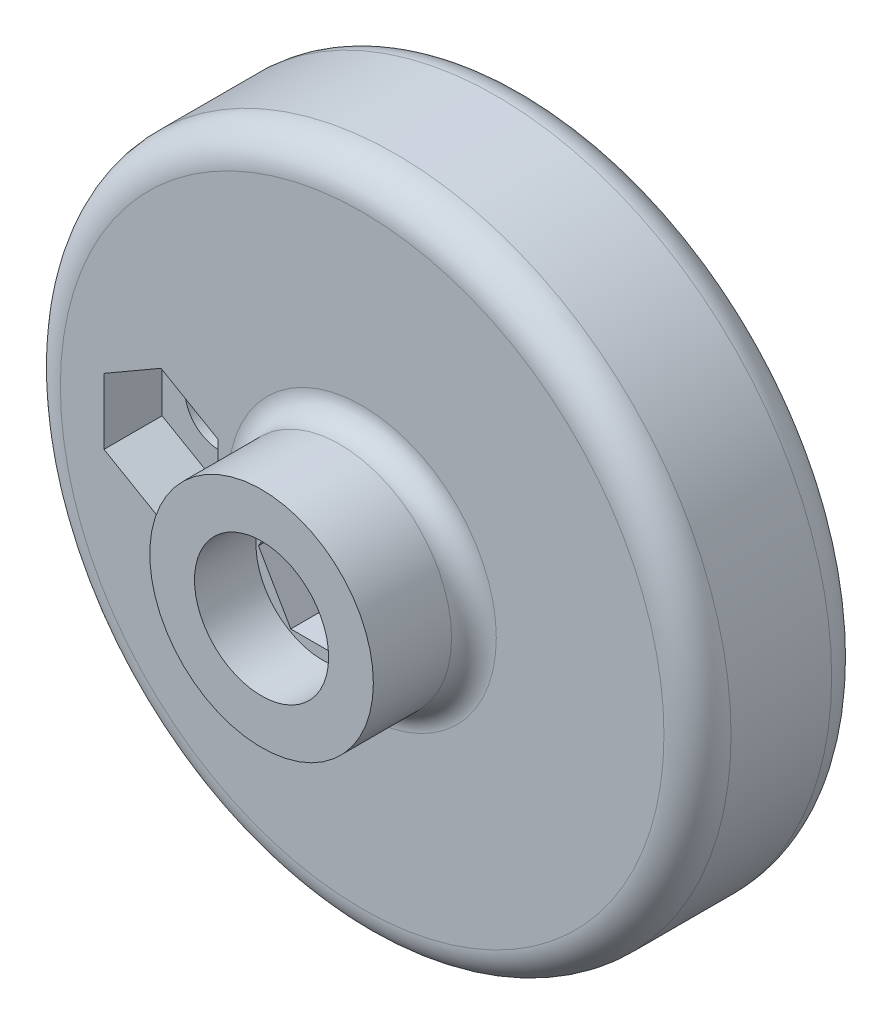
ISO-10303-21;
HEADER;
FILE_DESCRIPTION(('STEP AP214'),'2;1');
FILE_NAME('part.step','',(''),(''),'','','');
FILE_SCHEMA(('AUTOMOTIVE_DESIGN { 1 0 10303 214 1 1 1 1 }'));
ENDSEC;
DATA;
#1=APPLICATION_CONTEXT('core data for automotive mechanical design processes');
#2=APPLICATION_PROTOCOL_DEFINITION('international standard','automotive_design',2000,#1);
#3=PRODUCT_CONTEXT('',#1,'mechanical');
#4=PRODUCT('Part','Part','',(#3));
#5=PRODUCT_RELATED_PRODUCT_CATEGORY('part','',(#4));
#6=PRODUCT_DEFINITION_FORMATION('','',#4);
#7=PRODUCT_DEFINITION_CONTEXT('part definition',#1,'design');
#8=PRODUCT_DEFINITION('design','',#6,#7);
#9=PRODUCT_DEFINITION_SHAPE('','',#8);
#10=(LENGTH_UNIT() NAMED_UNIT(*) SI_UNIT(.MILLI.,.METRE.));
#11=(NAMED_UNIT(*) PLANE_ANGLE_UNIT() SI_UNIT($,.RADIAN.));
#12=(NAMED_UNIT(*) SI_UNIT($,.STERADIAN.) SOLID_ANGLE_UNIT());
#13=UNCERTAINTY_MEASURE_WITH_UNIT(LENGTH_MEASURE(1.E-05),#10,'distance_accuracy_value','');
#14=(GEOMETRIC_REPRESENTATION_CONTEXT(3) GLOBAL_UNCERTAINTY_ASSIGNED_CONTEXT((#13)) GLOBAL_UNIT_ASSIGNED_CONTEXT((#10,
#11,#12)) REPRESENTATION_CONTEXT('',''));
#15=CARTESIAN_POINT('',(0.,0.,0.));
#16=DIRECTION('',(0.,0.,1.));
#17=DIRECTION('',(1.,0.,0.));
#18=AXIS2_PLACEMENT_3D('',#15,#16,#17);
#19=CARTESIAN_POINT('',(0.,0.,0.));
#20=DIRECTION('',(0.,0.,1.));
#21=DIRECTION('',(1.,0.,0.));
#22=AXIS2_PLACEMENT_3D('',#19,#20,#21);
#23=CYLINDRICAL_SURFACE('',#22,3.25);
#24=CARTESIAN_POINT('',(0.,0.,3.));
#25=DIRECTION('',(0.,0.,1.));
#26=DIRECTION('',(1.,0.,0.));
#27=AXIS2_PLACEMENT_3D('',#24,#25,#26);
#28=CIRCLE('',#27,3.25);
#29=CARTESIAN_POINT('',(3.25,0.,3.));
#30=VERTEX_POINT('',#29);
#31=EDGE_CURVE('E242',#30,#30,#28,.F.);
#32=ORIENTED_EDGE('',*,*,#31,.T.);
#33=EDGE_LOOP('',(#32));
#34=FACE_BOUND('',#33,.T.);
#35=CARTESIAN_POINT('',(0.,0.,13.));
#36=DIRECTION('',(0.,0.,1.));
#37=DIRECTION('',(1.,0.,0.));
#38=AXIS2_PLACEMENT_3D('',#35,#36,#37);
#39=CIRCLE('',#38,3.25);
#40=CARTESIAN_POINT('',(3.25,0.,13.));
#41=VERTEX_POINT('',#40);
#42=EDGE_CURVE('E169',#41,#41,#39,.F.);
#43=ORIENTED_EDGE('',*,*,#42,.F.);
#44=EDGE_LOOP('',(#43));
#45=FACE_BOUND('',#44,.T.);
#46=ADVANCED_FACE('F32',(#34,#45),#23,.F.);
#47=CARTESIAN_POINT('',(-18.,0.,0.));
#48=DIRECTION('',(0.,0.,1.));
#49=DIRECTION('',(1.,0.,0.));
#50=AXIS2_PLACEMENT_3D('',#47,#48,#49);
#51=CYLINDRICAL_SURFACE('',#50,3.05);
#52=CARTESIAN_POINT('',(-18.,0.,0.));
#53=DIRECTION('',(0.,0.,1.));
#54=DIRECTION('',(1.,0.,0.));
#55=AXIS2_PLACEMENT_3D('',#52,#53,#54);
#56=CIRCLE('',#55,3.05);
#57=CARTESIAN_POINT('',(-14.95,0.,0.));
#58=VERTEX_POINT('',#57);
#59=EDGE_CURVE('E230',#58,#58,#56,.T.);
#60=ORIENTED_EDGE('',*,*,#59,.F.);
#61=EDGE_LOOP('',(#60));
#62=FACE_BOUND('',#61,.T.);
#63=CARTESIAN_POINT('',(-18.,0.,9.8));
#64=DIRECTION('',(0.,0.,1.));
#65=DIRECTION('',(1.,0.,0.));
#66=AXIS2_PLACEMENT_3D('',#63,#64,#65);
#67=CIRCLE('',#66,3.05);
#68=CARTESIAN_POINT('',(-14.95,0.,9.8));
#69=VERTEX_POINT('',#68);
#70=EDGE_CURVE('E220',#69,#69,#67,.F.);
#71=ORIENTED_EDGE('',*,*,#70,.F.);
#72=EDGE_LOOP('',(#71));
#73=FACE_BOUND('',#72,.T.);
#74=ADVANCED_FACE('F272',(#62,#73),#51,.F.);
#75=CARTESIAN_POINT('',(0.,0.,15.));
#76=DIRECTION('',(0.,0.,1.));
#77=DIRECTION('',(1.,0.,0.));
#78=AXIS2_PLACEMENT_3D('',#75,#76,#77);
#79=PLANE('',#78);
#80=CARTESIAN_POINT('',(0.,0.,15.));
#81=DIRECTION('',(0.,0.,1.));
#82=DIRECTION('',(1.,0.,0.));
#83=AXIS2_PLACEMENT_3D('',#80,#81,#82);
#84=CIRCLE('',#83,12.);
#85=CARTESIAN_POINT('',(12.,0.,15.));
#86=VERTEX_POINT('',#85);
#87=EDGE_CURVE('E11',#86,#86,#84,.F.);
#88=ORIENTED_EDGE('',*,*,#87,.T.);
#89=EDGE_LOOP('',(#88));
#90=FACE_BOUND('',#89,.T.);
#91=DIRECTION('',(-0.866025403784438,-0.5,0.));
#92=VECTOR('',#91,1.);
#93=CARTESIAN_POINT('',(-18.,5.88897274573418,15.));
#94=LINE('',#93,#92);
#95=CARTESIAN_POINT('',(-18.,5.88897274573418,15.));
#96=VERTEX_POINT('',#95);
#97=CARTESIAN_POINT('',(-23.1,2.94448637286709,15.));
#98=VERTEX_POINT('',#97);
#99=EDGE_CURVE('E55',#96,#98,#94,.T.);
#100=ORIENTED_EDGE('',*,*,#99,.F.);
#101=DIRECTION('',(-0.866025403784438,0.5,0.));
#102=VECTOR('',#101,1.);
#103=CARTESIAN_POINT('',(-12.9,2.94448637286709,15.));
#104=LINE('',#103,#102);
#105=CARTESIAN_POINT('',(-12.9,2.94448637286709,15.));
#106=VERTEX_POINT('',#105);
#107=EDGE_CURVE('E187',#106,#96,#104,.T.);
#108=ORIENTED_EDGE('',*,*,#107,.F.);
#109=DIRECTION('',(0.,1.,0.));
#110=VECTOR('',#109,1.);
#111=CARTESIAN_POINT('',(-12.9,-2.94448637286709,15.));
#112=LINE('',#111,#110);
#113=CARTESIAN_POINT('',(-12.9,-2.94448637286709,15.));
#114=VERTEX_POINT('',#113);
#115=EDGE_CURVE('E213',#114,#106,#112,.T.);
#116=ORIENTED_EDGE('',*,*,#115,.F.);
#117=DIRECTION('',(0.866025403784438,0.5,0.));
#118=VECTOR('',#117,1.);
#119=CARTESIAN_POINT('',(-18.,-5.88897274573418,15.));
#120=LINE('',#119,#118);
#121=CARTESIAN_POINT('',(-18.,-5.88897274573418,15.));
#122=VERTEX_POINT('',#121);
#123=EDGE_CURVE('E210',#122,#114,#120,.T.);
#124=ORIENTED_EDGE('',*,*,#123,.F.);
#125=DIRECTION('',(0.866025403784439,-0.5,0.));
#126=VECTOR('',#125,1.);
#127=CARTESIAN_POINT('',(-23.1,-2.94448637286709,15.));
#128=LINE('',#127,#126);
#129=CARTESIAN_POINT('',(-23.1,-2.94448637286709,15.));
#130=VERTEX_POINT('',#129);
#131=EDGE_CURVE('E207',#130,#122,#128,.T.);
#132=ORIENTED_EDGE('',*,*,#131,.F.);
#133=DIRECTION('',(0.,-1.,0.));
#134=VECTOR('',#133,1.);
#135=CARTESIAN_POINT('',(-23.1,2.94448637286709,15.));
#136=LINE('',#135,#134);
#137=EDGE_CURVE('E204',#98,#130,#136,.T.);
#138=ORIENTED_EDGE('',*,*,#137,.F.);
#139=EDGE_LOOP('',(#100,#108,#116,#124,#132,#138));
#140=FACE_BOUND('',#139,.T.);
#141=CARTESIAN_POINT('',(0.,0.,15.));
#142=DIRECTION('',(0.,0.,1.));
#143=DIRECTION('',(1.,0.,0.));
#144=AXIS2_PLACEMENT_3D('',#141,#142,#143);
#145=CIRCLE('',#144,27.);
#146=CARTESIAN_POINT('',(27.,0.,15.));
#147=VERTEX_POINT('',#146);
#148=EDGE_CURVE('E251',#147,#147,#145,.T.);
#149=ORIENTED_EDGE('',*,*,#148,.T.);
#150=EDGE_LOOP('',(#149));
#151=FACE_BOUND('',#150,.T.);
#152=ADVANCED_FACE('F278',(#90,#140,#151),#79,.T.);
#153=CARTESIAN_POINT('',(0.,0.,15.));
#154=DIRECTION('',(0.,0.,-1.));
#155=DIRECTION('',(-1.,0.,0.));
#156=AXIS2_PLACEMENT_3D('',#153,#154,#155);
#157=CYLINDRICAL_SURFACE('',#156,30.);
#158=CARTESIAN_POINT('',(0.,0.,3.));
#159=DIRECTION('',(0.,0.,1.));
#160=DIRECTION('',(1.,0.,0.));
#161=AXIS2_PLACEMENT_3D('',#158,#159,#160);
#162=CIRCLE('',#161,30.);
#163=CARTESIAN_POINT('',(30.,0.,3.));
#164=VERTEX_POINT('',#163);
#165=EDGE_CURVE('E248',#164,#164,#162,.T.);
#166=ORIENTED_EDGE('',*,*,#165,.T.);
#167=EDGE_LOOP('',(#166));
#168=FACE_BOUND('',#167,.T.);
#169=CARTESIAN_POINT('',(0.,0.,12.));
#170=DIRECTION('',(0.,0.,1.));
#171=DIRECTION('',(1.,0.,0.));
#172=AXIS2_PLACEMENT_3D('',#169,#170,#171);
#173=CIRCLE('',#172,30.);
#174=CARTESIAN_POINT('',(30.,0.,12.));
#175=VERTEX_POINT('',#174);
#176=EDGE_CURVE('E245',#175,#175,#173,.F.);
#177=ORIENTED_EDGE('',*,*,#176,.T.);
#178=EDGE_LOOP('',(#177));
#179=FACE_BOUND('',#178,.T.);
#180=ADVANCED_FACE('F294',(#168,#179),#157,.T.);
#181=CARTESIAN_POINT('',(0.,0.,0.));
#182=DIRECTION('',(0.,0.,1.));
#183=DIRECTION('',(1.,0.,0.));
#184=AXIS2_PLACEMENT_3D('',#181,#182,#183);
#185=PLANE('',#184);
#186=ORIENTED_EDGE('',*,*,#59,.T.);
#187=EDGE_LOOP('',(#186));
#188=FACE_BOUND('',#187,.T.);
#189=CARTESIAN_POINT('',(0.,0.,0.));
#190=DIRECTION('',(0.,0.,1.));
#191=DIRECTION('',(1.,0.,0.));
#192=AXIS2_PLACEMENT_3D('',#189,#190,#191);
#193=CIRCLE('',#192,6.25);
#194=CARTESIAN_POINT('',(6.25,0.,0.));
#195=VERTEX_POINT('',#194);
#196=EDGE_CURVE('E239',#195,#195,#193,.T.);
#197=ORIENTED_EDGE('',*,*,#196,.T.);
#198=EDGE_LOOP('',(#197));
#199=FACE_BOUND('',#198,.T.);
#200=CARTESIAN_POINT('',(0.,0.,0.));
#201=DIRECTION('',(0.,0.,1.));
#202=DIRECTION('',(1.,0.,0.));
#203=AXIS2_PLACEMENT_3D('',#200,#201,#202);
#204=CIRCLE('',#203,27.);
#205=CARTESIAN_POINT('',(27.,0.,0.));
#206=VERTEX_POINT('',#205);
#207=EDGE_CURVE('E236',#206,#206,#204,.F.);
#208=ORIENTED_EDGE('',*,*,#207,.T.);
#209=EDGE_LOOP('',(#208));
#210=FACE_BOUND('',#209,.T.);
#211=ADVANCED_FACE('F291',(#188,#199,#210),#185,.F.);
#212=CARTESIAN_POINT('',(0.,0.,24.));
#213=DIRECTION('',(0.,0.,-1.));
#214=DIRECTION('',(-1.,0.,0.));
#215=AXIS2_PLACEMENT_3D('',#212,#213,#214);
#216=CYLINDRICAL_SURFACE('',#215,10.);
#217=CARTESIAN_POINT('',(0.,0.,17.));
#218=DIRECTION('',(0.,0.,1.));
#219=DIRECTION('',(1.,0.,0.));
#220=AXIS2_PLACEMENT_3D('',#217,#218,#219);
#221=CIRCLE('',#220,10.);
#222=CARTESIAN_POINT('',(10.,0.,17.));
#223=VERTEX_POINT('',#222);
#224=EDGE_CURVE('E40',#223,#223,#221,.T.);
#225=ORIENTED_EDGE('',*,*,#224,.T.);
#226=EDGE_LOOP('',(#225));
#227=FACE_BOUND('',#226,.T.);
#228=CARTESIAN_POINT('',(0.,0.,24.));
#229=DIRECTION('',(0.,0.,1.));
#230=DIRECTION('',(1.,0.,0.));
#231=AXIS2_PLACEMENT_3D('',#228,#229,#230);
#232=CIRCLE('',#231,10.);
#233=CARTESIAN_POINT('',(10.,0.,24.));
#234=VERTEX_POINT('',#233);
#235=EDGE_CURVE('E233',#234,#234,#232,.T.);
#236=ORIENTED_EDGE('',*,*,#235,.F.);
#237=EDGE_LOOP('',(#236));
#238=FACE_BOUND('',#237,.T.);
#239=ADVANCED_FACE('F260',(#227,#238),#216,.T.);
#240=CARTESIAN_POINT('',(0.,0.,24.));
#241=DIRECTION('',(0.,0.,1.));
#242=DIRECTION('',(1.,0.,0.));
#243=AXIS2_PLACEMENT_3D('',#240,#241,#242);
#244=PLANE('',#243);
#245=CARTESIAN_POINT('',(0.,0.,24.));
#246=DIRECTION('',(0.,0.,1.));
#247=DIRECTION('',(1.,0.,0.));
#248=AXIS2_PLACEMENT_3D('',#245,#246,#247);
#249=CIRCLE('',#248,6.);
#250=CARTESIAN_POINT('',(6.,0.,24.));
#251=VERTEX_POINT('',#250);
#252=EDGE_CURVE('E180',#251,#251,#249,.T.);
#253=ORIENTED_EDGE('',*,*,#252,.F.);
#254=EDGE_LOOP('',(#253));
#255=FACE_BOUND('',#254,.T.);
#256=ORIENTED_EDGE('',*,*,#235,.T.);
#257=EDGE_LOOP('',(#256));
#258=FACE_BOUND('',#257,.T.);
#259=ADVANCED_FACE('F284',(#255,#258),#244,.T.);
#260=CARTESIAN_POINT('',(0.,0.,3.));
#261=DIRECTION('',(0.,0.,1.));
#262=DIRECTION('',(1.,0.,0.));
#263=AXIS2_PLACEMENT_3D('',#260,#261,#262);
#264=TOROIDAL_SURFACE('',#263,6.25,3.);
#265=ORIENTED_EDGE('',*,*,#31,.F.);
#266=EDGE_LOOP('',(#265));
#267=FACE_BOUND('',#266,.T.);
#268=ORIENTED_EDGE('',*,*,#196,.F.);
#269=EDGE_LOOP('',(#268));
#270=FACE_BOUND('',#269,.T.);
#271=ADVANCED_FACE('F287',(#267,#270),#264,.T.);
#272=CARTESIAN_POINT('',(0.,0.,3.));
#273=DIRECTION('',(0.,0.,1.));
#274=DIRECTION('',(1.,0.,0.));
#275=AXIS2_PLACEMENT_3D('',#272,#273,#274);
#276=TOROIDAL_SURFACE('',#275,27.,3.);
#277=ORIENTED_EDGE('',*,*,#207,.F.);
#278=EDGE_LOOP('',(#277));
#279=FACE_BOUND('',#278,.T.);
#280=ORIENTED_EDGE('',*,*,#165,.F.);
#281=EDGE_LOOP('',(#280));
#282=FACE_BOUND('',#281,.T.);
#283=ADVANCED_FACE('F304',(#279,#282),#276,.T.);
#284=CARTESIAN_POINT('',(0.,0.,12.));
#285=DIRECTION('',(0.,0.,1.));
#286=DIRECTION('',(1.,0.,0.));
#287=AXIS2_PLACEMENT_3D('',#284,#285,#286);
#288=TOROIDAL_SURFACE('',#287,27.,3.);
#289=ORIENTED_EDGE('',*,*,#176,.F.);
#290=EDGE_LOOP('',(#289));
#291=FACE_BOUND('',#290,.T.);
#292=ORIENTED_EDGE('',*,*,#148,.F.);
#293=EDGE_LOOP('',(#292));
#294=FACE_BOUND('',#293,.T.);
#295=ADVANCED_FACE('F307',(#291,#294),#288,.T.);
#296=CARTESIAN_POINT('',(0.,0.,9.8));
#297=DIRECTION('',(0.,0.,1.));
#298=DIRECTION('',(1.,0.,0.));
#299=AXIS2_PLACEMENT_3D('',#296,#297,#298);
#300=PLANE('',#299);
#301=DIRECTION('',(-0.866025403784438,-0.5,0.));
#302=VECTOR('',#301,1.);
#303=CARTESIAN_POINT('',(-18.,5.88897274573418,9.8));
#304=LINE('',#303,#302);
#305=CARTESIAN_POINT('',(-18.,5.88897274573418,9.8));
#306=VERTEX_POINT('',#305);
#307=CARTESIAN_POINT('',(-23.1,2.94448637286709,9.8));
#308=VERTEX_POINT('',#307);
#309=EDGE_CURVE('E183',#306,#308,#304,.T.);
#310=ORIENTED_EDGE('',*,*,#309,.T.);
#311=DIRECTION('',(0.,-1.,0.));
#312=VECTOR('',#311,1.);
#313=CARTESIAN_POINT('',(-23.1,2.94448637286709,9.8));
#314=LINE('',#313,#312);
#315=CARTESIAN_POINT('',(-23.1,-2.94448637286709,9.8));
#316=VERTEX_POINT('',#315);
#317=EDGE_CURVE('E186',#308,#316,#314,.T.);
#318=ORIENTED_EDGE('',*,*,#317,.T.);
#319=DIRECTION('',(0.866025403784439,-0.5,0.));
#320=VECTOR('',#319,1.);
#321=CARTESIAN_POINT('',(-23.1,-2.94448637286709,9.8));
#322=LINE('',#321,#320);
#323=CARTESIAN_POINT('',(-18.,-5.88897274573418,9.8));
#324=VERTEX_POINT('',#323);
#325=EDGE_CURVE('E190',#316,#324,#322,.T.);
#326=ORIENTED_EDGE('',*,*,#325,.T.);
#327=DIRECTION('',(0.866025403784438,0.5,0.));
#328=VECTOR('',#327,1.);
#329=CARTESIAN_POINT('',(-18.,-5.88897274573418,9.8));
#330=LINE('',#329,#328);
#331=CARTESIAN_POINT('',(-12.9,-2.94448637286709,9.8));
#332=VERTEX_POINT('',#331);
#333=EDGE_CURVE('E193',#324,#332,#330,.T.);
#334=ORIENTED_EDGE('',*,*,#333,.T.);
#335=DIRECTION('',(0.,1.,0.));
#336=VECTOR('',#335,1.);
#337=CARTESIAN_POINT('',(-12.9,-2.94448637286709,9.8));
#338=LINE('',#337,#336);
#339=CARTESIAN_POINT('',(-12.9,2.94448637286709,9.8));
#340=VERTEX_POINT('',#339);
#341=EDGE_CURVE('E196',#332,#340,#338,.T.);
#342=ORIENTED_EDGE('',*,*,#341,.T.);
#343=DIRECTION('',(-0.866025403784438,0.5,0.));
#344=VECTOR('',#343,1.);
#345=CARTESIAN_POINT('',(-12.9,2.94448637286709,9.8));
#346=LINE('',#345,#344);
#347=EDGE_CURVE('E199',#340,#306,#346,.T.);
#348=ORIENTED_EDGE('',*,*,#347,.T.);
#349=EDGE_LOOP('',(#310,#318,#326,#334,#342,#348));
#350=FACE_BOUND('',#349,.T.);
#351=ORIENTED_EDGE('',*,*,#70,.T.);
#352=EDGE_LOOP('',(#351));
#353=FACE_BOUND('',#352,.T.);
#354=ADVANCED_FACE('F310',(#350,#353),#300,.T.);
#355=CARTESIAN_POINT('',(-18.,5.88897274573418,9.8));
#356=DIRECTION('',(-0.5,0.866025403784439,0.));
#357=DIRECTION('',(-0.866025403784439,-0.5,0.));
#358=AXIS2_PLACEMENT_3D('',#355,#356,#357);
#359=PLANE('',#358);
#360=ORIENTED_EDGE('',*,*,#99,.T.);
#361=DIRECTION('',(0.,0.,1.));
#362=VECTOR('',#361,1.);
#363=CARTESIAN_POINT('',(-23.1,2.94448637286709,9.8));
#364=LINE('',#363,#362);
#365=EDGE_CURVE('E202',#308,#98,#364,.T.);
#366=ORIENTED_EDGE('',*,*,#365,.F.);
#367=ORIENTED_EDGE('',*,*,#309,.F.);
#368=DIRECTION('',(0.,0.,1.));
#369=VECTOR('',#368,1.);
#370=CARTESIAN_POINT('',(-18.,5.88897274573418,9.8));
#371=LINE('',#370,#369);
#372=EDGE_CURVE('E218',#306,#96,#371,.T.);
#373=ORIENTED_EDGE('',*,*,#372,.T.);
#374=EDGE_LOOP('',(#360,#366,#367,#373));
#375=FACE_BOUND('',#374,.T.);
#376=ADVANCED_FACE('F315',(#375),#359,.F.);
#377=CARTESIAN_POINT('',(-12.9,2.94448637286709,9.8));
#378=DIRECTION('',(0.5,0.866025403784439,0.));
#379=DIRECTION('',(-0.866025403784439,0.5,0.));
#380=AXIS2_PLACEMENT_3D('',#377,#378,#379);
#381=PLANE('',#380);
#382=ORIENTED_EDGE('',*,*,#107,.T.);
#383=ORIENTED_EDGE('',*,*,#372,.F.);
#384=ORIENTED_EDGE('',*,*,#347,.F.);
#385=DIRECTION('',(0.,0.,1.));
#386=VECTOR('',#385,1.);
#387=CARTESIAN_POINT('',(-12.9,2.94448637286709,9.8));
#388=LINE('',#387,#386);
#389=EDGE_CURVE('E221',#340,#106,#388,.T.);
#390=ORIENTED_EDGE('',*,*,#389,.T.);
#391=EDGE_LOOP('',(#382,#383,#384,#390));
#392=FACE_BOUND('',#391,.T.);
#393=ADVANCED_FACE('F326',(#392),#381,.F.);
#394=CARTESIAN_POINT('',(-12.9,-2.94448637286709,9.8));
#395=DIRECTION('',(1.,0.,0.));
#396=DIRECTION('',(0.,0.,-1.));
#397=AXIS2_PLACEMENT_3D('',#394,#395,#396);
#398=PLANE('',#397);
#399=ORIENTED_EDGE('',*,*,#115,.T.);
#400=ORIENTED_EDGE('',*,*,#389,.F.);
#401=ORIENTED_EDGE('',*,*,#341,.F.);
#402=DIRECTION('',(0.,0.,1.));
#403=VECTOR('',#402,1.);
#404=CARTESIAN_POINT('',(-12.9,-2.94448637286709,9.8));
#405=LINE('',#404,#403);
#406=EDGE_CURVE('E223',#332,#114,#405,.T.);
#407=ORIENTED_EDGE('',*,*,#406,.T.);
#408=EDGE_LOOP('',(#399,#400,#401,#407));
#409=FACE_BOUND('',#408,.T.);
#410=ADVANCED_FACE('F334',(#409),#398,.F.);
#411=CARTESIAN_POINT('',(-18.,-5.88897274573418,9.8));
#412=DIRECTION('',(0.5,-0.866025403784438,0.));
#413=DIRECTION('',(0.866025403784438,0.5,0.));
#414=AXIS2_PLACEMENT_3D('',#411,#412,#413);
#415=PLANE('',#414);
#416=ORIENTED_EDGE('',*,*,#123,.T.);
#417=ORIENTED_EDGE('',*,*,#406,.F.);
#418=ORIENTED_EDGE('',*,*,#333,.F.);
#419=DIRECTION('',(0.,0.,1.));
#420=VECTOR('',#419,1.);
#421=CARTESIAN_POINT('',(-18.,-5.88897274573418,9.8));
#422=LINE('',#421,#420);
#423=EDGE_CURVE('E225',#324,#122,#422,.T.);
#424=ORIENTED_EDGE('',*,*,#423,.T.);
#425=EDGE_LOOP('',(#416,#417,#418,#424));
#426=FACE_BOUND('',#425,.T.);
#427=ADVANCED_FACE('F338',(#426),#415,.F.);
#428=CARTESIAN_POINT('',(-23.1,-2.94448637286709,9.8));
#429=DIRECTION('',(-0.5,-0.866025403784439,0.));
#430=DIRECTION('',(0.866025403784439,-0.5,0.));
#431=AXIS2_PLACEMENT_3D('',#428,#429,#430);
#432=PLANE('',#431);
#433=ORIENTED_EDGE('',*,*,#131,.T.);
#434=ORIENTED_EDGE('',*,*,#423,.F.);
#435=ORIENTED_EDGE('',*,*,#325,.F.);
#436=DIRECTION('',(0.,0.,1.));
#437=VECTOR('',#436,1.);
#438=CARTESIAN_POINT('',(-23.1,-2.94448637286709,9.8));
#439=LINE('',#438,#437);
#440=EDGE_CURVE('E227',#316,#130,#439,.T.);
#441=ORIENTED_EDGE('',*,*,#440,.T.);
#442=EDGE_LOOP('',(#433,#434,#435,#441));
#443=FACE_BOUND('',#442,.T.);
#444=ADVANCED_FACE('F342',(#443),#432,.F.);
#445=CARTESIAN_POINT('',(-23.1,2.94448637286709,9.8));
#446=DIRECTION('',(-1.,0.,0.));
#447=DIRECTION('',(0.,0.,1.));
#448=AXIS2_PLACEMENT_3D('',#445,#446,#447);
#449=PLANE('',#448);
#450=ORIENTED_EDGE('',*,*,#137,.T.);
#451=ORIENTED_EDGE('',*,*,#440,.F.);
#452=ORIENTED_EDGE('',*,*,#317,.F.);
#453=ORIENTED_EDGE('',*,*,#365,.T.);
#454=EDGE_LOOP('',(#450,#451,#452,#453));
#455=FACE_BOUND('',#454,.T.);
#456=ADVANCED_FACE('F346',(#455),#449,.F.);
#457=CARTESIAN_POINT('',(0.,0.,18.5));
#458=DIRECTION('',(0.,0.,1.));
#459=DIRECTION('',(1.,0.,0.));
#460=AXIS2_PLACEMENT_3D('',#457,#458,#459);
#461=PLANE('',#460);
#462=DIRECTION('',(0.5,0.866025403784439,0.));
#463=VECTOR('',#462,1.);
#464=CARTESIAN_POINT('',(2.88675134594813,-5.,18.5));
#465=LINE('',#464,#463);
#466=CARTESIAN_POINT('',(2.88675134594813,-5.,18.5));
#467=VERTEX_POINT('',#466);
#468=CARTESIAN_POINT('',(5.77350269189626,0.,18.5));
#469=VERTEX_POINT('',#468);
#470=EDGE_CURVE('E47',#467,#469,#465,.T.);
#471=ORIENTED_EDGE('',*,*,#470,.F.);
#472=DIRECTION('',(1.,0.,0.));
#473=VECTOR('',#472,1.);
#474=CARTESIAN_POINT('',(-2.88675134594813,-5.,18.5));
#475=LINE('',#474,#473);
#476=CARTESIAN_POINT('',(-2.88675134594813,-5.,18.5));
#477=VERTEX_POINT('',#476);
#478=EDGE_CURVE('E143',#477,#467,#475,.T.);
#479=ORIENTED_EDGE('',*,*,#478,.F.);
#480=DIRECTION('',(0.5,-0.866025403784438,0.));
#481=VECTOR('',#480,1.);
#482=CARTESIAN_POINT('',(-5.77350269189626,0.,18.5));
#483=LINE('',#482,#481);
#484=CARTESIAN_POINT('',(-5.77350269189626,0.,18.5));
#485=VERTEX_POINT('',#484);
#486=EDGE_CURVE('E146',#485,#477,#483,.T.);
#487=ORIENTED_EDGE('',*,*,#486,.F.);
#488=DIRECTION('',(-0.5,-0.866025403784439,0.));
#489=VECTOR('',#488,1.);
#490=CARTESIAN_POINT('',(-2.88675134594813,5.,18.5));
#491=LINE('',#490,#489);
#492=CARTESIAN_POINT('',(-2.88675134594813,5.,18.5));
#493=VERTEX_POINT('',#492);
#494=EDGE_CURVE('E162',#493,#485,#491,.T.);
#495=ORIENTED_EDGE('',*,*,#494,.F.);
#496=DIRECTION('',(-1.,0.,0.));
#497=VECTOR('',#496,1.);
#498=CARTESIAN_POINT('',(2.88675134594813,5.,18.5));
#499=LINE('',#498,#497);
#500=CARTESIAN_POINT('',(2.88675134594813,5.,18.5));
#501=VERTEX_POINT('',#500);
#502=EDGE_CURVE('E159',#501,#493,#499,.T.);
#503=ORIENTED_EDGE('',*,*,#502,.F.);
#504=DIRECTION('',(-0.5,0.866025403784438,0.));
#505=VECTOR('',#504,1.);
#506=CARTESIAN_POINT('',(5.77350269189626,0.,18.5));
#507=LINE('',#506,#505);
#508=EDGE_CURVE('E157',#469,#501,#507,.T.);
#509=ORIENTED_EDGE('',*,*,#508,.F.);
#510=EDGE_LOOP('',(#471,#479,#487,#495,#503,#509));
#511=FACE_BOUND('',#510,.T.);
#512=CARTESIAN_POINT('',(0.,0.,18.5));
#513=DIRECTION('',(0.,0.,1.));
#514=DIRECTION('',(1.,0.,0.));
#515=AXIS2_PLACEMENT_3D('',#512,#513,#514);
#516=CIRCLE('',#515,6.);
#517=CARTESIAN_POINT('',(6.,0.,18.5));
#518=VERTEX_POINT('',#517);
#519=EDGE_CURVE('E177',#518,#518,#516,.T.);
#520=ORIENTED_EDGE('',*,*,#519,.T.);
#521=EDGE_LOOP('',(#520));
#522=FACE_BOUND('',#521,.T.);
#523=ADVANCED_FACE('F349',(#511,#522),#461,.T.);
#524=CARTESIAN_POINT('',(0.,0.,18.5));
#525=DIRECTION('',(0.,0.,1.));
#526=DIRECTION('',(1.,0.,0.));
#527=AXIS2_PLACEMENT_3D('',#524,#525,#526);
#528=CYLINDRICAL_SURFACE('',#527,6.);
#529=ORIENTED_EDGE('',*,*,#519,.F.);
#530=EDGE_LOOP('',(#529));
#531=FACE_BOUND('',#530,.T.);
#532=ORIENTED_EDGE('',*,*,#252,.T.);
#533=EDGE_LOOP('',(#532));
#534=FACE_BOUND('',#533,.T.);
#535=ADVANCED_FACE('F330',(#531,#534),#528,.F.);
#536=CARTESIAN_POINT('',(0.,0.,13.));
#537=DIRECTION('',(0.,0.,1.));
#538=DIRECTION('',(1.,0.,0.));
#539=AXIS2_PLACEMENT_3D('',#536,#537,#538);
#540=PLANE('',#539);
#541=DIRECTION('',(0.5,0.866025403784439,0.));
#542=VECTOR('',#541,1.);
#543=CARTESIAN_POINT('',(2.88675134594813,-5.,13.));
#544=LINE('',#543,#542);
#545=CARTESIAN_POINT('',(2.88675134594813,-5.,13.));
#546=VERTEX_POINT('',#545);
#547=CARTESIAN_POINT('',(5.77350269189626,0.,13.));
#548=VERTEX_POINT('',#547);
#549=EDGE_CURVE('E123',#546,#548,#544,.T.);
#550=ORIENTED_EDGE('',*,*,#549,.T.);
#551=DIRECTION('',(-0.5,0.866025403784438,0.));
#552=VECTOR('',#551,1.);
#553=CARTESIAN_POINT('',(5.77350269189626,0.,13.));
#554=LINE('',#553,#552);
#555=CARTESIAN_POINT('',(2.88675134594813,5.,13.));
#556=VERTEX_POINT('',#555);
#557=EDGE_CURVE('E132',#548,#556,#554,.T.);
#558=ORIENTED_EDGE('',*,*,#557,.T.);
#559=DIRECTION('',(-1.,0.,0.));
#560=VECTOR('',#559,1.);
#561=CARTESIAN_POINT('',(2.88675134594813,5.,13.));
#562=LINE('',#561,#560);
#563=CARTESIAN_POINT('',(-2.88675134594813,5.,13.));
#564=VERTEX_POINT('',#563);
#565=EDGE_CURVE('E137',#556,#564,#562,.T.);
#566=ORIENTED_EDGE('',*,*,#565,.T.);
#567=DIRECTION('',(-0.5,-0.866025403784439,0.));
#568=VECTOR('',#567,1.);
#569=CARTESIAN_POINT('',(-2.88675134594813,5.,13.));
#570=LINE('',#569,#568);
#571=CARTESIAN_POINT('',(-5.77350269189626,0.,13.));
#572=VERTEX_POINT('',#571);
#573=EDGE_CURVE('E150',#564,#572,#570,.T.);
#574=ORIENTED_EDGE('',*,*,#573,.T.);
#575=DIRECTION('',(0.5,-0.866025403784438,0.));
#576=VECTOR('',#575,1.);
#577=CARTESIAN_POINT('',(-5.77350269189626,0.,13.));
#578=LINE('',#577,#576);
#579=CARTESIAN_POINT('',(-2.88675134594813,-5.,13.));
#580=VERTEX_POINT('',#579);
#581=EDGE_CURVE('E153',#572,#580,#578,.T.);
#582=ORIENTED_EDGE('',*,*,#581,.T.);
#583=DIRECTION('',(1.,0.,0.));
#584=VECTOR('',#583,1.);
#585=CARTESIAN_POINT('',(-2.88675134594813,-5.,13.));
#586=LINE('',#585,#584);
#587=EDGE_CURVE('E129',#580,#546,#586,.T.);
#588=ORIENTED_EDGE('',*,*,#587,.T.);
#589=EDGE_LOOP('',(#550,#558,#566,#574,#582,#588));
#590=FACE_BOUND('',#589,.T.);
#591=ORIENTED_EDGE('',*,*,#42,.T.);
#592=EDGE_LOOP('',(#591));
#593=FACE_BOUND('',#592,.T.);
#594=ADVANCED_FACE('F139',(#590,#593),#540,.T.);
#595=CARTESIAN_POINT('',(2.88675134594813,-5.,13.));
#596=DIRECTION('',(0.866025403784439,-0.5,0.));
#597=DIRECTION('',(0.5,0.866025403784439,0.));
#598=AXIS2_PLACEMENT_3D('',#595,#596,#597);
#599=PLANE('',#598);
#600=ORIENTED_EDGE('',*,*,#470,.T.);
#601=DIRECTION('',(0.,0.,1.));
#602=VECTOR('',#601,1.);
#603=CARTESIAN_POINT('',(5.77350269189626,0.,13.));
#604=LINE('',#603,#602);
#605=EDGE_CURVE('E119',#548,#469,#604,.T.);
#606=ORIENTED_EDGE('',*,*,#605,.F.);
#607=ORIENTED_EDGE('',*,*,#549,.F.);
#608=DIRECTION('',(0.,0.,1.));
#609=VECTOR('',#608,1.);
#610=CARTESIAN_POINT('',(2.88675134594813,-5.,13.));
#611=LINE('',#610,#609);
#612=EDGE_CURVE('E167',#546,#467,#611,.T.);
#613=ORIENTED_EDGE('',*,*,#612,.T.);
#614=EDGE_LOOP('',(#600,#606,#607,#613));
#615=FACE_BOUND('',#614,.T.);
#616=ADVANCED_FACE('F121',(#615),#599,.F.);
#617=CARTESIAN_POINT('',(-2.88675134594813,-5.,13.));
#618=DIRECTION('',(0.,-1.,0.));
#619=DIRECTION('',(1.,0.,0.));
#620=AXIS2_PLACEMENT_3D('',#617,#618,#619);
#621=PLANE('',#620);
#622=ORIENTED_EDGE('',*,*,#478,.T.);
#623=ORIENTED_EDGE('',*,*,#612,.F.);
#624=ORIENTED_EDGE('',*,*,#587,.F.);
#625=DIRECTION('',(0.,0.,1.));
#626=VECTOR('',#625,1.);
#627=CARTESIAN_POINT('',(-2.88675134594813,-5.,13.));
#628=LINE('',#627,#626);
#629=EDGE_CURVE('E170',#580,#477,#628,.T.);
#630=ORIENTED_EDGE('',*,*,#629,.T.);
#631=EDGE_LOOP('',(#622,#623,#624,#630));
#632=FACE_BOUND('',#631,.T.);
#633=ADVANCED_FACE('F374',(#632),#621,.F.);
#634=CARTESIAN_POINT('',(-5.77350269189626,0.,13.));
#635=DIRECTION('',(-0.866025403784439,-0.5,0.));
#636=DIRECTION('',(0.5,-0.866025403784439,0.));
#637=AXIS2_PLACEMENT_3D('',#634,#635,#636);
#638=PLANE('',#637);
#639=ORIENTED_EDGE('',*,*,#486,.T.);
#640=ORIENTED_EDGE('',*,*,#629,.F.);
#641=ORIENTED_EDGE('',*,*,#581,.F.);
#642=DIRECTION('',(0.,0.,1.));
#643=VECTOR('',#642,1.);
#644=CARTESIAN_POINT('',(-5.77350269189626,0.,13.));
#645=LINE('',#644,#643);
#646=EDGE_CURVE('E172',#572,#485,#645,.T.);
#647=ORIENTED_EDGE('',*,*,#646,.T.);
#648=EDGE_LOOP('',(#639,#640,#641,#647));
#649=FACE_BOUND('',#648,.T.);
#650=ADVANCED_FACE('F382',(#649),#638,.F.);
#651=CARTESIAN_POINT('',(-2.88675134594813,5.,13.));
#652=DIRECTION('',(-0.866025403784439,0.5,0.));
#653=DIRECTION('',(-0.5,-0.866025403784439,0.));
#654=AXIS2_PLACEMENT_3D('',#651,#652,#653);
#655=PLANE('',#654);
#656=ORIENTED_EDGE('',*,*,#494,.T.);
#657=ORIENTED_EDGE('',*,*,#646,.F.);
#658=ORIENTED_EDGE('',*,*,#573,.F.);
#659=DIRECTION('',(0.,0.,1.));
#660=VECTOR('',#659,1.);
#661=CARTESIAN_POINT('',(-2.88675134594813,5.,13.));
#662=LINE('',#661,#660);
#663=EDGE_CURVE('E174',#564,#493,#662,.T.);
#664=ORIENTED_EDGE('',*,*,#663,.T.);
#665=EDGE_LOOP('',(#656,#657,#658,#664));
#666=FACE_BOUND('',#665,.T.);
#667=ADVANCED_FACE('F378',(#666),#655,.F.);
#668=CARTESIAN_POINT('',(2.88675134594813,5.,13.));
#669=DIRECTION('',(0.,1.,0.));
#670=DIRECTION('',(0.,0.,1.));
#671=AXIS2_PLACEMENT_3D('',#668,#669,#670);
#672=PLANE('',#671);
#673=ORIENTED_EDGE('',*,*,#502,.T.);
#674=ORIENTED_EDGE('',*,*,#663,.F.);
#675=ORIENTED_EDGE('',*,*,#565,.F.);
#676=DIRECTION('',(0.,0.,1.));
#677=VECTOR('',#676,1.);
#678=CARTESIAN_POINT('',(2.88675134594813,5.,13.));
#679=LINE('',#678,#677);
#680=EDGE_CURVE('E128',#556,#501,#679,.T.);
#681=ORIENTED_EDGE('',*,*,#680,.T.);
#682=EDGE_LOOP('',(#673,#674,#675,#681));
#683=FACE_BOUND('',#682,.T.);
#684=ADVANCED_FACE('F268',(#683),#672,.F.);
#685=CARTESIAN_POINT('',(5.77350269189626,0.,13.));
#686=DIRECTION('',(0.866025403784438,0.5,0.));
#687=DIRECTION('',(-0.5,0.866025403784438,0.));
#688=AXIS2_PLACEMENT_3D('',#685,#686,#687);
#689=PLANE('',#688);
#690=ORIENTED_EDGE('',*,*,#508,.T.);
#691=ORIENTED_EDGE('',*,*,#680,.F.);
#692=ORIENTED_EDGE('',*,*,#557,.F.);
#693=ORIENTED_EDGE('',*,*,#605,.T.);
#694=EDGE_LOOP('',(#690,#691,#692,#693));
#695=FACE_BOUND('',#694,.T.);
#696=ADVANCED_FACE('F133',(#695),#689,.F.);
#697=CARTESIAN_POINT('',(0.,0.,17.));
#698=DIRECTION('',(0.,0.,1.));
#699=DIRECTION('',(1.,0.,0.));
#700=AXIS2_PLACEMENT_3D('',#697,#698,#699);
#701=TOROIDAL_SURFACE('',#700,12.,2.);
#702=ORIENTED_EDGE('',*,*,#87,.F.);
#703=EDGE_LOOP('',(#702));
#704=FACE_BOUND('',#703,.T.);
#705=ORIENTED_EDGE('',*,*,#224,.F.);
#706=EDGE_LOOP('',(#705));
#707=FACE_BOUND('',#706,.T.);
#708=ADVANCED_FACE('F34',(#704,#707),#701,.F.);
#709=CLOSED_SHELL('',(#46,#74,#152,#180,#211,#239,#259,#271,#283,#295,#354,#376,#393,#410,#427,
#444,#456,#523,#535,#594,#616,#633,#650,#667,#684,#696,#708));
#710=MANIFOLD_SOLID_BREP('B2',#709);
#711=ADVANCED_BREP_SHAPE_REPRESENTATION('',(#18,#710),#14);
#712=SHAPE_DEFINITION_REPRESENTATION(#9,#711);
ENDSEC;
END-ISO-10303-21;
